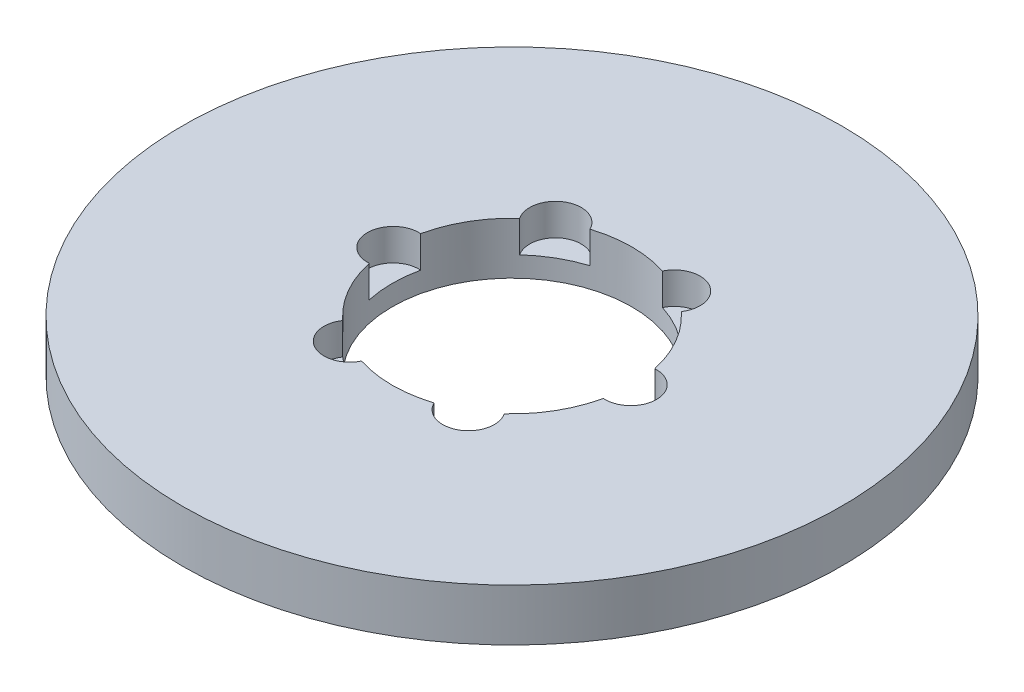
ISO-10303-21;
HEADER;
FILE_DESCRIPTION(('STEP AP214'),'2;1');
FILE_NAME('part.step','',(''),(''),'','','');
FILE_SCHEMA(('AUTOMOTIVE_DESIGN { 1 0 10303 214 1 1 1 1 }'));
ENDSEC;
DATA;
#1=APPLICATION_CONTEXT('core data for automotive mechanical design processes');
#2=APPLICATION_PROTOCOL_DEFINITION('international standard','automotive_design',2000,#1);
#3=PRODUCT_CONTEXT('',#1,'mechanical');
#4=PRODUCT('Part','Part','',(#3));
#5=PRODUCT_RELATED_PRODUCT_CATEGORY('part','',(#4));
#6=PRODUCT_DEFINITION_FORMATION('','',#4);
#7=PRODUCT_DEFINITION_CONTEXT('part definition',#1,'design');
#8=PRODUCT_DEFINITION('design','',#6,#7);
#9=PRODUCT_DEFINITION_SHAPE('','',#8);
#10=(LENGTH_UNIT() NAMED_UNIT(*) SI_UNIT(.MILLI.,.METRE.));
#11=(NAMED_UNIT(*) PLANE_ANGLE_UNIT() SI_UNIT($,.RADIAN.));
#12=(NAMED_UNIT(*) SI_UNIT($,.STERADIAN.) SOLID_ANGLE_UNIT());
#13=UNCERTAINTY_MEASURE_WITH_UNIT(LENGTH_MEASURE(1.E-05),#10,'distance_accuracy_value','');
#14=(GEOMETRIC_REPRESENTATION_CONTEXT(3) GLOBAL_UNCERTAINTY_ASSIGNED_CONTEXT((#13)) GLOBAL_UNIT_ASSIGNED_CONTEXT((#10,
#11,#12)) REPRESENTATION_CONTEXT('',''));
#15=CARTESIAN_POINT('',(0.,0.,0.));
#16=DIRECTION('',(0.,0.,1.));
#17=DIRECTION('',(1.,0.,0.));
#18=AXIS2_PLACEMENT_3D('',#15,#16,#17);
#19=CARTESIAN_POINT('',(0.,13.,0.));
#20=DIRECTION('',(0.,-1.,0.));
#21=DIRECTION('',(0.,0.,-1.));
#22=AXIS2_PLACEMENT_3D('',#19,#20,#21);
#23=CYLINDRICAL_SURFACE('',#22,82.5);
#24=CARTESIAN_POINT('',(0.,13.,0.));
#25=DIRECTION('',(0.,1.,0.));
#26=DIRECTION('',(0.,0.,1.));
#27=AXIS2_PLACEMENT_3D('',#24,#25,#26);
#28=CIRCLE('',#27,82.5);
#29=CARTESIAN_POINT('',(0.,13.,-82.5));
#30=VERTEX_POINT('',#29);
#31=EDGE_CURVE('E171',#30,#30,#28,.T.);
#32=CARTESIAN_POINT('',(0.,0.,0.));
#33=DIRECTION('',(0.,1.,0.));
#34=DIRECTION('',(0.,0.,1.));
#35=AXIS2_PLACEMENT_3D('',#32,#33,#34);
#36=CIRCLE('',#35,82.5);
#37=CARTESIAN_POINT('',(0.,0.,-82.5));
#38=VERTEX_POINT('',#37);
#39=EDGE_CURVE('E157',#38,#38,#36,.T.);
#40=CARTESIAN_POINT('',(0.,13.,-82.5));
#41=CARTESIAN_POINT('',(0.,12.8645833333333,-82.5));
#42=CARTESIAN_POINT('',(0.,12.7291666666667,-82.5));
#43=CARTESIAN_POINT('',(0.,12.4583333333333,-82.5));
#44=CARTESIAN_POINT('',(0.,12.3229166666667,-82.5));
#45=CARTESIAN_POINT('',(0.,12.0520833333333,-82.5));
#46=CARTESIAN_POINT('',(0.,11.9166666666667,-82.5));
#47=CARTESIAN_POINT('',(0.,11.6458333333333,-82.5));
#48=CARTESIAN_POINT('',(0.,11.5104166666667,-82.5));
#49=CARTESIAN_POINT('',(0.,11.2395833333333,-82.5));
#50=CARTESIAN_POINT('',(0.,11.1041666666667,-82.5));
#51=CARTESIAN_POINT('',(0.,10.8333333333333,-82.5));
#52=CARTESIAN_POINT('',(0.,10.6979166666667,-82.5));
#53=CARTESIAN_POINT('',(0.,10.4270833333333,-82.5));
#54=CARTESIAN_POINT('',(0.,10.2916666666667,-82.5));
#55=CARTESIAN_POINT('',(0.,10.0208333333333,-82.5));
#56=CARTESIAN_POINT('',(0.,9.88541666666667,-82.5));
#57=CARTESIAN_POINT('',(0.,9.61458333333333,-82.5));
#58=CARTESIAN_POINT('',(0.,9.47916666666667,-82.5));
#59=CARTESIAN_POINT('',(0.,9.20833333333333,-82.5));
#60=CARTESIAN_POINT('',(0.,9.07291666666667,-82.5));
#61=CARTESIAN_POINT('',(0.,8.80208333333333,-82.5));
#62=CARTESIAN_POINT('',(0.,8.66666666666667,-82.5));
#63=CARTESIAN_POINT('',(0.,8.39583333333333,-82.5));
#64=CARTESIAN_POINT('',(0.,8.26041666666667,-82.5));
#65=CARTESIAN_POINT('',(0.,7.98958333333333,-82.5));
#66=CARTESIAN_POINT('',(0.,7.85416666666667,-82.5));
#67=CARTESIAN_POINT('',(0.,7.58333333333333,-82.5));
#68=CARTESIAN_POINT('',(0.,7.44791666666667,-82.5));
#69=CARTESIAN_POINT('',(0.,7.17708333333333,-82.5));
#70=CARTESIAN_POINT('',(0.,7.04166666666667,-82.5));
#71=CARTESIAN_POINT('',(0.,6.77083333333333,-82.5));
#72=CARTESIAN_POINT('',(0.,6.63541666666667,-82.5));
#73=CARTESIAN_POINT('',(0.,6.36458333333333,-82.5));
#74=CARTESIAN_POINT('',(0.,6.22916666666667,-82.5));
#75=CARTESIAN_POINT('',(0.,5.95833333333333,-82.5));
#76=CARTESIAN_POINT('',(0.,5.82291666666667,-82.5));
#77=CARTESIAN_POINT('',(0.,5.55208333333333,-82.5));
#78=CARTESIAN_POINT('',(0.,5.41666666666667,-82.5));
#79=CARTESIAN_POINT('',(0.,5.14583333333333,-82.5));
#80=CARTESIAN_POINT('',(0.,5.01041666666667,-82.5));
#81=CARTESIAN_POINT('',(0.,4.73958333333333,-82.5));
#82=CARTESIAN_POINT('',(0.,4.60416666666667,-82.5));
#83=CARTESIAN_POINT('',(0.,4.33333333333333,-82.5));
#84=CARTESIAN_POINT('',(0.,4.19791666666667,-82.5));
#85=CARTESIAN_POINT('',(0.,3.92708333333333,-82.5));
#86=CARTESIAN_POINT('',(0.,3.79166666666667,-82.5));
#87=CARTESIAN_POINT('',(0.,3.52083333333333,-82.5));
#88=CARTESIAN_POINT('',(0.,3.38541666666667,-82.5));
#89=CARTESIAN_POINT('',(0.,3.11458333333333,-82.5));
#90=CARTESIAN_POINT('',(0.,2.97916666666667,-82.5));
#91=CARTESIAN_POINT('',(0.,2.70833333333333,-82.5));
#92=CARTESIAN_POINT('',(0.,2.57291666666667,-82.5));
#93=CARTESIAN_POINT('',(0.,2.30208333333333,-82.5));
#94=CARTESIAN_POINT('',(0.,2.16666666666667,-82.5));
#95=CARTESIAN_POINT('',(0.,1.89583333333333,-82.5));
#96=CARTESIAN_POINT('',(0.,1.76041666666667,-82.5));
#97=CARTESIAN_POINT('',(0.,1.48958333333333,-82.5));
#98=CARTESIAN_POINT('',(0.,1.35416666666667,-82.5));
#99=CARTESIAN_POINT('',(0.,1.08333333333333,-82.5));
#100=CARTESIAN_POINT('',(0.,0.947916666666667,-82.5));
#101=CARTESIAN_POINT('',(0.,0.677083333333334,-82.5));
#102=CARTESIAN_POINT('',(0.,0.541666666666667,-82.5));
#103=CARTESIAN_POINT('',(0.,0.270833333333334,-82.5));
#104=CARTESIAN_POINT('',(0.,0.135416666666667,-82.5));
#105=CARTESIAN_POINT('',(0.,0.,-82.5));
#106=B_SPLINE_CURVE_WITH_KNOTS('',3,(#40,#41,#42,#43,#44,#45,#46,#47,#48,#49,#50,#51,#52,#53,
#54,#55,#56,#57,#58,#59,#60,#61,#62,#63,#64,#65,#66,#67,#68,#69,#70,#71,#72,#73,#74,#75,#76,#77,
#78,#79,#80,#81,#82,#83,#84,#85,#86,#87,#88,#89,#90,#91,#92,#93,#94,#95,#96,#97,#98,#99,#100,
#101,#102,#103,#104,#105),.UNSPECIFIED.,.F.,.F.,(4,2,2,2,2,2,2,2,2,2,2,2,2,2,2,2,2,2,2,2,2,2,2,
2,2,2,2,2,2,2,2,2,4),(0.,0.406249999999999,0.812499999999999,1.21875,1.625,2.03125,2.4375,
2.84375,3.25,3.65625,4.0625,4.46875,4.875,5.28125,5.6875,6.09375,6.5,6.90625,7.3125,7.71875,
8.125,8.53125,8.9375,9.34375,9.75,10.15625,10.5625,10.96875,11.375,11.78125,12.1875,12.59375,
13.),.UNSPECIFIED.);
#107=EDGE_CURVE('BSEAM39',#30,#38,#106,.T.);
#108=ORIENTED_EDGE('',*,*,#31,.F.);
#109=ORIENTED_EDGE('',*,*,#39,.T.);
#110=ORIENTED_EDGE('',*,*,#107,.T.);
#111=ORIENTED_EDGE('',*,*,#107,.F.);
#112=EDGE_LOOP('',(#108,#110,#109,#111));
#113=FACE_BOUND('',#112,.T.);
#114=ADVANCED_FACE('F39',(#113),#23,.T.);
#115=CARTESIAN_POINT('',(0.,13.,0.));
#116=DIRECTION('',(0.,1.,0.));
#117=DIRECTION('',(0.,0.,1.));
#118=AXIS2_PLACEMENT_3D('',#115,#116,#117);
#119=PLANE('',#118);
#120=CARTESIAN_POINT('',(-14.8691706785594,13.,-25.7541590816776));
#121=DIRECTION('',(0.,1.,0.));
#122=DIRECTION('',(-0.866025403784433,0.,0.50000000000001));
#123=AXIS2_PLACEMENT_3D('',#120,#121,#122);
#124=CIRCLE('',#123,6.45171748222885);
#125=CARTESIAN_POINT('',(-9.07613420516261,13.,-28.5941215617804));
#126=VERTEX_POINT('',#125);
#127=CARTESIAN_POINT('',(-20.2251685688214,13.,-22.1572235707175));
#128=VERTEX_POINT('',#127);
#129=EDGE_CURVE('E214',#126,#128,#124,.T.);
#130=ORIENTED_EDGE('',*,*,#129,.F.);
#131=CARTESIAN_POINT('',(0.,13.,0.));
#132=DIRECTION('',(0.,1.,0.));
#133=DIRECTION('',(0.,0.,1.));
#134=AXIS2_PLACEMENT_3D('',#131,#132,#133);
#135=CIRCLE('',#134,30.);
#136=CARTESIAN_POINT('',(9.07613420516201,13.,-28.5941215617806));
#137=VERTEX_POINT('',#136);
#138=EDGE_CURVE('E272',#137,#126,#135,.T.);
#139=ORIENTED_EDGE('',*,*,#138,.F.);
#140=CARTESIAN_POINT('',(14.8691706785588,13.,-25.7541590816779));
#141=DIRECTION('',(0.,1.,0.));
#142=DIRECTION('',(-0.866025403784443,0.,-0.499999999999992));
#143=AXIS2_PLACEMENT_3D('',#140,#141,#142);
#144=CIRCLE('',#143,6.45171748222885);
#145=CARTESIAN_POINT('',(20.225168568821,13.,-22.1572235707179));
#146=VERTEX_POINT('',#145);
#147=EDGE_CURVE('E285',#146,#137,#144,.T.);
#148=ORIENTED_EDGE('',*,*,#147,.F.);
#149=CARTESIAN_POINT('',(29.3013027739835,13.,-6.43689799106285));
#150=VERTEX_POINT('',#149);
#151=EDGE_CURVE('E165',#150,#146,#135,.T.);
#152=ORIENTED_EDGE('',*,*,#151,.F.);
#153=CARTESIAN_POINT('',(29.7383413571182,13.,0.));
#154=DIRECTION('',(0.,1.,0.));
#155=DIRECTION('',(0.,0.,-1.));
#156=AXIS2_PLACEMENT_3D('',#153,#154,#155);
#157=CIRCLE('',#156,6.45171748222885);
#158=CARTESIAN_POINT('',(29.3013027739835,13.,6.43689799106285));
#159=VERTEX_POINT('',#158);
#160=EDGE_CURVE('E281',#159,#150,#157,.T.);
#161=ORIENTED_EDGE('',*,*,#160,.F.);
#162=CARTESIAN_POINT('',(20.2251685688213,13.,22.1572235707176));
#163=VERTEX_POINT('',#162);
#164=EDGE_CURVE('E160',#163,#159,#135,.T.);
#165=ORIENTED_EDGE('',*,*,#164,.F.);
#166=CARTESIAN_POINT('',(14.8691706785592,13.,25.7541590816777));
#167=DIRECTION('',(0.,1.,0.));
#168=DIRECTION('',(0.866025403784436,0.,-0.500000000000004));
#169=AXIS2_PLACEMENT_3D('',#166,#167,#168);
#170=CIRCLE('',#169,6.45171748222885);
#171=CARTESIAN_POINT('',(9.07613420516241,13.,28.5941215617805));
#172=VERTEX_POINT('',#171);
#173=EDGE_CURVE('E154',#172,#163,#170,.T.);
#174=ORIENTED_EDGE('',*,*,#173,.F.);
#175=CARTESIAN_POINT('',(-9.07613420516221,13.,28.5941215617806));
#176=VERTEX_POINT('',#175);
#177=EDGE_CURVE('E150',#176,#172,#135,.T.);
#178=ORIENTED_EDGE('',*,*,#177,.F.);
#179=CARTESIAN_POINT('',(-14.869170678559,13.,25.7541590816778));
#180=DIRECTION('',(0.,1.,0.));
#181=DIRECTION('',(0.86602540378444,0.,0.499999999999998));
#182=AXIS2_PLACEMENT_3D('',#179,#180,#181);
#183=CIRCLE('',#182,6.45171748222885);
#184=CARTESIAN_POINT('',(-20.2251685688211,13.,22.1572235707177));
#185=VERTEX_POINT('',#184);
#186=EDGE_CURVE('E127',#185,#176,#183,.T.);
#187=ORIENTED_EDGE('',*,*,#186,.F.);
#188=CARTESIAN_POINT('',(-29.3013027739835,13.,6.43689799106285));
#189=VERTEX_POINT('',#188);
#190=EDGE_CURVE('E156',#189,#185,#135,.T.);
#191=ORIENTED_EDGE('',*,*,#190,.F.);
#192=CARTESIAN_POINT('',(-29.7383413571182,13.,0.));
#193=DIRECTION('',(0.,1.,0.));
#194=DIRECTION('',(0.,0.,1.));
#195=AXIS2_PLACEMENT_3D('',#192,#193,#194);
#196=CIRCLE('',#195,6.45171748222885);
#197=CARTESIAN_POINT('',(-29.3013027739835,13.,-6.43689799106285));
#198=VERTEX_POINT('',#197);
#199=EDGE_CURVE('E164',#198,#189,#196,.T.);
#200=ORIENTED_EDGE('',*,*,#199,.F.);
#201=EDGE_CURVE('E159',#128,#198,#135,.T.);
#202=ORIENTED_EDGE('',*,*,#201,.F.);
#203=EDGE_LOOP('',(#130,#139,#148,#152,#161,#165,#174,#178,#187,#191,#200,#202));
#204=FACE_BOUND('',#203,.T.);
#205=ORIENTED_EDGE('',*,*,#31,.T.);
#206=EDGE_LOOP('',(#205));
#207=FACE_BOUND('',#206,.T.);
#208=ADVANCED_FACE('F155',(#204,#207),#119,.T.);
#209=CARTESIAN_POINT('',(0.,0.,0.));
#210=DIRECTION('',(0.,1.,0.));
#211=DIRECTION('',(0.,0.,1.));
#212=AXIS2_PLACEMENT_3D('',#209,#210,#211);
#213=PLANE('',#212);
#214=CARTESIAN_POINT('',(0.,0.,0.));
#215=DIRECTION('',(0.,1.,0.));
#216=DIRECTION('',(0.,0.,1.));
#217=AXIS2_PLACEMENT_3D('',#214,#215,#216);
#218=CIRCLE('',#217,30.);
#219=CARTESIAN_POINT('',(0.,0.,30.));
#220=VERTEX_POINT('',#219);
#221=EDGE_CURVE('E170',#220,#220,#218,.T.);
#222=ORIENTED_EDGE('',*,*,#221,.T.);
#223=EDGE_LOOP('',(#222));
#224=FACE_BOUND('',#223,.T.);
#225=ORIENTED_EDGE('',*,*,#39,.F.);
#226=EDGE_LOOP('',(#225));
#227=FACE_BOUND('',#226,.T.);
#228=ADVANCED_FACE('F232',(#224,#227),#213,.F.);
#229=CARTESIAN_POINT('',(0.,13.,0.));
#230=DIRECTION('',(0.,-1.,0.));
#231=DIRECTION('',(0.,0.,-1.));
#232=AXIS2_PLACEMENT_3D('',#229,#230,#231);
#233=CYLINDRICAL_SURFACE('',#232,30.);
#234=DIRECTION('',(0.,1.,0.));
#235=VECTOR('',#234,1.);
#236=CARTESIAN_POINT('',(-9.07613420516261,9.03915069976995,-28.5941215617804));
#237=LINE('',#236,#235);
#238=CARTESIAN_POINT('',(-9.07613420516261,5.0783013995399,-28.5941215617804));
#239=VERTEX_POINT('',#238);
#240=EDGE_CURVE('E11',#239,#126,#237,.T.);
#241=ORIENTED_EDGE('',*,*,#240,.F.);
#242=CARTESIAN_POINT('',(0.,5.0783013995399,0.));
#243=DIRECTION('',(0.,1.,0.));
#244=DIRECTION('',(0.,0.,1.));
#245=AXIS2_PLACEMENT_3D('',#242,#243,#244);
#246=CIRCLE('',#245,30.);
#247=CARTESIAN_POINT('',(-20.2251685688214,5.0783013995399,-22.1572235707175));
#248=VERTEX_POINT('',#247);
#249=EDGE_CURVE('E209',#239,#248,#246,.T.);
#250=ORIENTED_EDGE('',*,*,#249,.T.);
#251=DIRECTION('',(0.,1.,0.));
#252=VECTOR('',#251,1.);
#253=CARTESIAN_POINT('',(-20.2251685688214,9.03915069976995,-22.1572235707175));
#254=LINE('',#253,#252);
#255=EDGE_CURVE('E46',#128,#248,#254,.F.);
#256=ORIENTED_EDGE('',*,*,#255,.F.);
#257=ORIENTED_EDGE('',*,*,#201,.T.);
#258=DIRECTION('',(0.,1.,0.));
#259=VECTOR('',#258,1.);
#260=CARTESIAN_POINT('',(-29.3013027739835,9.03915069976995,-6.43689799106286));
#261=LINE('',#260,#259);
#262=CARTESIAN_POINT('',(-29.3013027739835,5.0783013995399,-6.43689799106285));
#263=VERTEX_POINT('',#262);
#264=EDGE_CURVE('E185',#263,#198,#261,.T.);
#265=ORIENTED_EDGE('',*,*,#264,.F.);
#266=CARTESIAN_POINT('',(0.,5.0783013995399,0.));
#267=DIRECTION('',(0.,1.,0.));
#268=DIRECTION('',(0.,0.,1.));
#269=AXIS2_PLACEMENT_3D('',#266,#267,#268);
#270=CIRCLE('',#269,30.);
#271=CARTESIAN_POINT('',(-29.3013027739835,5.0783013995399,6.43689799106285));
#272=VERTEX_POINT('',#271);
#273=EDGE_CURVE('E173',#263,#272,#270,.T.);
#274=ORIENTED_EDGE('',*,*,#273,.T.);
#275=DIRECTION('',(0.,1.,0.));
#276=VECTOR('',#275,1.);
#277=CARTESIAN_POINT('',(-29.3013027739835,9.03915069976995,6.43689799106286));
#278=LINE('',#277,#276);
#279=EDGE_CURVE('E178',#189,#272,#278,.F.);
#280=ORIENTED_EDGE('',*,*,#279,.F.);
#281=ORIENTED_EDGE('',*,*,#190,.T.);
#282=DIRECTION('',(0.,1.,0.));
#283=VECTOR('',#282,1.);
#284=CARTESIAN_POINT('',(-20.2251685688211,9.03915069976995,22.1572235707177));
#285=LINE('',#284,#283);
#286=CARTESIAN_POINT('',(-20.2251685688211,5.0783013995399,22.1572235707177));
#287=VERTEX_POINT('',#286);
#288=EDGE_CURVE('E132',#287,#185,#285,.T.);
#289=ORIENTED_EDGE('',*,*,#288,.F.);
#290=CARTESIAN_POINT('',(0.,5.0783013995399,0.));
#291=DIRECTION('',(0.,1.,0.));
#292=DIRECTION('',(0.,0.,1.));
#293=AXIS2_PLACEMENT_3D('',#290,#291,#292);
#294=CIRCLE('',#293,30.);
#295=CARTESIAN_POINT('',(-9.07613420516221,5.0783013995399,28.5941215617806));
#296=VERTEX_POINT('',#295);
#297=EDGE_CURVE('E146',#287,#296,#294,.T.);
#298=ORIENTED_EDGE('',*,*,#297,.T.);
#299=DIRECTION('',(0.,1.,0.));
#300=VECTOR('',#299,1.);
#301=CARTESIAN_POINT('',(-9.07613420516222,9.03915069976995,28.5941215617806));
#302=LINE('',#301,#300);
#303=EDGE_CURVE('E128',#176,#296,#302,.F.);
#304=ORIENTED_EDGE('',*,*,#303,.F.);
#305=ORIENTED_EDGE('',*,*,#177,.T.);
#306=DIRECTION('',(0.,1.,0.));
#307=VECTOR('',#306,1.);
#308=CARTESIAN_POINT('',(9.07613420516241,9.03915069976995,28.5941215617805));
#309=LINE('',#308,#307);
#310=CARTESIAN_POINT('',(9.07613420516241,5.0783013995399,28.5941215617805));
#311=VERTEX_POINT('',#310);
#312=EDGE_CURVE('E192',#311,#172,#309,.T.);
#313=ORIENTED_EDGE('',*,*,#312,.F.);
#314=CARTESIAN_POINT('',(0.,5.0783013995399,0.));
#315=DIRECTION('',(0.,1.,0.));
#316=DIRECTION('',(0.,0.,1.));
#317=AXIS2_PLACEMENT_3D('',#314,#315,#316);
#318=CIRCLE('',#317,30.);
#319=CARTESIAN_POINT('',(20.2251685688213,5.0783013995399,22.1572235707176));
#320=VERTEX_POINT('',#319);
#321=EDGE_CURVE('E190',#311,#320,#318,.T.);
#322=ORIENTED_EDGE('',*,*,#321,.T.);
#323=DIRECTION('',(0.,1.,0.));
#324=VECTOR('',#323,1.);
#325=CARTESIAN_POINT('',(20.2251685688213,9.03915069976995,22.1572235707176));
#326=LINE('',#325,#324);
#327=EDGE_CURVE('E189',#163,#320,#326,.F.);
#328=ORIENTED_EDGE('',*,*,#327,.F.);
#329=ORIENTED_EDGE('',*,*,#164,.T.);
#330=DIRECTION('',(0.,1.,0.));
#331=VECTOR('',#330,1.);
#332=CARTESIAN_POINT('',(29.3013027739835,9.03915069976995,6.43689799106286));
#333=LINE('',#332,#331);
#334=CARTESIAN_POINT('',(29.3013027739835,5.0783013995399,6.43689799106285));
#335=VERTEX_POINT('',#334);
#336=EDGE_CURVE('E203',#335,#159,#333,.T.);
#337=ORIENTED_EDGE('',*,*,#336,.F.);
#338=CARTESIAN_POINT('',(0.,5.0783013995399,0.));
#339=DIRECTION('',(0.,1.,0.));
#340=DIRECTION('',(0.,0.,1.));
#341=AXIS2_PLACEMENT_3D('',#338,#339,#340);
#342=CIRCLE('',#341,30.);
#343=CARTESIAN_POINT('',(29.3013027739835,5.0783013995399,-6.43689799106285));
#344=VERTEX_POINT('',#343);
#345=EDGE_CURVE('E194',#335,#344,#342,.T.);
#346=ORIENTED_EDGE('',*,*,#345,.T.);
#347=DIRECTION('',(0.,1.,0.));
#348=VECTOR('',#347,1.);
#349=CARTESIAN_POINT('',(29.3013027739835,9.03915069976995,-6.43689799106286));
#350=LINE('',#349,#348);
#351=EDGE_CURVE('E196',#150,#344,#350,.F.);
#352=ORIENTED_EDGE('',*,*,#351,.F.);
#353=ORIENTED_EDGE('',*,*,#151,.T.);
#354=DIRECTION('',(0.,1.,0.));
#355=VECTOR('',#354,1.);
#356=CARTESIAN_POINT('',(20.225168568821,9.03915069976995,-22.1572235707179));
#357=LINE('',#356,#355);
#358=CARTESIAN_POINT('',(20.225168568821,5.0783013995399,-22.1572235707179));
#359=VERTEX_POINT('',#358);
#360=EDGE_CURVE('E208',#359,#146,#357,.T.);
#361=ORIENTED_EDGE('',*,*,#360,.F.);
#362=CARTESIAN_POINT('',(0.,5.0783013995399,0.));
#363=DIRECTION('',(0.,1.,0.));
#364=DIRECTION('',(0.,0.,1.));
#365=AXIS2_PLACEMENT_3D('',#362,#363,#364);
#366=CIRCLE('',#365,30.);
#367=CARTESIAN_POINT('',(9.07613420516201,5.0783013995399,-28.5941215617806));
#368=VERTEX_POINT('',#367);
#369=EDGE_CURVE('E201',#359,#368,#366,.T.);
#370=ORIENTED_EDGE('',*,*,#369,.T.);
#371=DIRECTION('',(0.,1.,0.));
#372=VECTOR('',#371,1.);
#373=CARTESIAN_POINT('',(9.07613420516202,9.03915069976995,-28.5941215617806));
#374=LINE('',#373,#372);
#375=EDGE_CURVE('E206',#137,#368,#374,.F.);
#376=ORIENTED_EDGE('',*,*,#375,.F.);
#377=ORIENTED_EDGE('',*,*,#138,.T.);
#378=EDGE_LOOP('',(#241,#250,#256,#257,#265,#274,#280,#281,#289,#298,#304,#305,#313,#322,#328,
#329,#337,#346,#352,#353,#361,#370,#376,#377));
#379=FACE_BOUND('',#378,.T.);
#380=ORIENTED_EDGE('',*,*,#221,.F.);
#381=EDGE_LOOP('',(#380));
#382=FACE_BOUND('',#381,.T.);
#383=ADVANCED_FACE('F145',(#379,#382),#233,.F.);
#384=CARTESIAN_POINT('',(-29.7383413571182,5.0783013995399,0.));
#385=DIRECTION('',(0.,1.,0.));
#386=DIRECTION('',(0.,0.,1.));
#387=AXIS2_PLACEMENT_3D('',#384,#385,#386);
#388=CYLINDRICAL_SURFACE('',#387,6.45171748222885);
#389=ORIENTED_EDGE('',*,*,#264,.T.);
#390=ORIENTED_EDGE('',*,*,#199,.T.);
#391=ORIENTED_EDGE('',*,*,#279,.T.);
#392=CARTESIAN_POINT('',(-29.7383413571182,5.0783013995399,0.));
#393=DIRECTION('',(0.,1.,0.));
#394=DIRECTION('',(0.,0.,1.));
#395=AXIS2_PLACEMENT_3D('',#392,#393,#394);
#396=CIRCLE('',#395,6.45171748222885);
#397=EDGE_CURVE('E168',#263,#272,#396,.T.);
#398=ORIENTED_EDGE('',*,*,#397,.F.);
#399=EDGE_LOOP('',(#389,#390,#391,#398));
#400=FACE_BOUND('',#399,.T.);
#401=ADVANCED_FACE('F243',(#400),#388,.F.);
#402=CARTESIAN_POINT('',(-29.7383413571182,5.0783013995399,0.));
#403=DIRECTION('',(0.,1.,0.));
#404=DIRECTION('',(0.,0.,1.));
#405=AXIS2_PLACEMENT_3D('',#402,#403,#404);
#406=PLANE('',#405);
#407=ORIENTED_EDGE('',*,*,#397,.T.);
#408=ORIENTED_EDGE('',*,*,#273,.F.);
#409=EDGE_LOOP('',(#407,#408));
#410=FACE_BOUND('',#409,.T.);
#411=ADVANCED_FACE('F247',(#410),#406,.T.);
#412=CARTESIAN_POINT('',(-14.869170678559,5.0783013995399,25.7541590816778));
#413=DIRECTION('',(0.,1.,0.));
#414=DIRECTION('',(0.,0.,1.));
#415=AXIS2_PLACEMENT_3D('',#412,#413,#414);
#416=CYLINDRICAL_SURFACE('',#415,6.45171748222885);
#417=ORIENTED_EDGE('',*,*,#288,.T.);
#418=ORIENTED_EDGE('',*,*,#186,.T.);
#419=ORIENTED_EDGE('',*,*,#303,.T.);
#420=CARTESIAN_POINT('',(-14.869170678559,5.0783013995399,25.7541590816778));
#421=DIRECTION('',(0.,1.,0.));
#422=DIRECTION('',(0.86602540378444,0.,0.499999999999998));
#423=AXIS2_PLACEMENT_3D('',#420,#421,#422);
#424=CIRCLE('',#423,6.45171748222885);
#425=EDGE_CURVE('E137',#287,#296,#424,.T.);
#426=ORIENTED_EDGE('',*,*,#425,.F.);
#427=EDGE_LOOP('',(#417,#418,#419,#426));
#428=FACE_BOUND('',#427,.T.);
#429=ADVANCED_FACE('F126',(#428),#416,.F.);
#430=CARTESIAN_POINT('',(-14.869170678559,5.0783013995399,25.7541590816778));
#431=DIRECTION('',(0.,1.,0.));
#432=DIRECTION('',(0.86602540378444,0.,0.499999999999998));
#433=AXIS2_PLACEMENT_3D('',#430,#431,#432);
#434=PLANE('',#433);
#435=ORIENTED_EDGE('',*,*,#425,.T.);
#436=ORIENTED_EDGE('',*,*,#297,.F.);
#437=EDGE_LOOP('',(#435,#436));
#438=FACE_BOUND('',#437,.T.);
#439=ADVANCED_FACE('F254',(#438),#434,.T.);
#440=CARTESIAN_POINT('',(14.8691706785592,5.0783013995399,25.7541590816777));
#441=DIRECTION('',(0.,1.,0.));
#442=DIRECTION('',(0.,0.,1.));
#443=AXIS2_PLACEMENT_3D('',#440,#441,#442);
#444=CYLINDRICAL_SURFACE('',#443,6.45171748222885);
#445=ORIENTED_EDGE('',*,*,#312,.T.);
#446=ORIENTED_EDGE('',*,*,#173,.T.);
#447=ORIENTED_EDGE('',*,*,#327,.T.);
#448=CARTESIAN_POINT('',(14.8691706785592,5.0783013995399,25.7541590816777));
#449=DIRECTION('',(0.,1.,0.));
#450=DIRECTION('',(0.866025403784436,0.,-0.500000000000004));
#451=AXIS2_PLACEMENT_3D('',#448,#449,#450);
#452=CIRCLE('',#451,6.45171748222885);
#453=EDGE_CURVE('E138',#311,#320,#452,.T.);
#454=ORIENTED_EDGE('',*,*,#453,.F.);
#455=EDGE_LOOP('',(#445,#446,#447,#454));
#456=FACE_BOUND('',#455,.T.);
#457=ADVANCED_FACE('F260',(#456),#444,.F.);
#458=CARTESIAN_POINT('',(14.8691706785592,5.0783013995399,25.7541590816777));
#459=DIRECTION('',(0.,1.,0.));
#460=DIRECTION('',(0.866025403784436,0.,-0.500000000000004));
#461=AXIS2_PLACEMENT_3D('',#458,#459,#460);
#462=PLANE('',#461);
#463=ORIENTED_EDGE('',*,*,#453,.T.);
#464=ORIENTED_EDGE('',*,*,#321,.F.);
#465=EDGE_LOOP('',(#463,#464));
#466=FACE_BOUND('',#465,.T.);
#467=ADVANCED_FACE('F265',(#466),#462,.T.);
#468=CARTESIAN_POINT('',(29.7383413571182,5.0783013995399,0.));
#469=DIRECTION('',(0.,1.,0.));
#470=DIRECTION('',(0.,0.,1.));
#471=AXIS2_PLACEMENT_3D('',#468,#469,#470);
#472=CYLINDRICAL_SURFACE('',#471,6.45171748222885);
#473=ORIENTED_EDGE('',*,*,#336,.T.);
#474=ORIENTED_EDGE('',*,*,#160,.T.);
#475=ORIENTED_EDGE('',*,*,#351,.T.);
#476=CARTESIAN_POINT('',(29.7383413571182,5.0783013995399,0.));
#477=DIRECTION('',(0.,1.,0.));
#478=DIRECTION('',(0.,0.,-1.));
#479=AXIS2_PLACEMENT_3D('',#476,#477,#478);
#480=CIRCLE('',#479,6.45171748222885);
#481=EDGE_CURVE('E287',#335,#344,#480,.T.);
#482=ORIENTED_EDGE('',*,*,#481,.F.);
#483=EDGE_LOOP('',(#473,#474,#475,#482));
#484=FACE_BOUND('',#483,.T.);
#485=ADVANCED_FACE('F300',(#484),#472,.F.);
#486=CARTESIAN_POINT('',(29.7383413571182,5.0783013995399,0.));
#487=DIRECTION('',(0.,1.,0.));
#488=DIRECTION('',(0.,0.,-1.));
#489=AXIS2_PLACEMENT_3D('',#486,#487,#488);
#490=PLANE('',#489);
#491=ORIENTED_EDGE('',*,*,#481,.T.);
#492=ORIENTED_EDGE('',*,*,#345,.F.);
#493=EDGE_LOOP('',(#491,#492));
#494=FACE_BOUND('',#493,.T.);
#495=ADVANCED_FACE('F298',(#494),#490,.T.);
#496=CARTESIAN_POINT('',(14.8691706785588,5.0783013995399,-25.7541590816779));
#497=DIRECTION('',(0.,1.,0.));
#498=DIRECTION('',(0.,0.,1.));
#499=AXIS2_PLACEMENT_3D('',#496,#497,#498);
#500=CYLINDRICAL_SURFACE('',#499,6.45171748222885);
#501=ORIENTED_EDGE('',*,*,#360,.T.);
#502=ORIENTED_EDGE('',*,*,#147,.T.);
#503=ORIENTED_EDGE('',*,*,#375,.T.);
#504=CARTESIAN_POINT('',(14.8691706785588,5.0783013995399,-25.7541590816779));
#505=DIRECTION('',(0.,1.,0.));
#506=DIRECTION('',(-0.866025403784443,0.,-0.499999999999992));
#507=AXIS2_PLACEMENT_3D('',#504,#505,#506);
#508=CIRCLE('',#507,6.45171748222885);
#509=EDGE_CURVE('E56',#359,#368,#508,.T.);
#510=ORIENTED_EDGE('',*,*,#509,.F.);
#511=EDGE_LOOP('',(#501,#502,#503,#510));
#512=FACE_BOUND('',#511,.T.);
#513=ADVANCED_FACE('F301',(#512),#500,.F.);
#514=CARTESIAN_POINT('',(14.8691706785588,5.0783013995399,-25.7541590816779));
#515=DIRECTION('',(0.,1.,0.));
#516=DIRECTION('',(-0.866025403784443,0.,-0.499999999999992));
#517=AXIS2_PLACEMENT_3D('',#514,#515,#516);
#518=PLANE('',#517);
#519=ORIENTED_EDGE('',*,*,#509,.T.);
#520=ORIENTED_EDGE('',*,*,#369,.F.);
#521=EDGE_LOOP('',(#519,#520));
#522=FACE_BOUND('',#521,.T.);
#523=ADVANCED_FACE('F221',(#522),#518,.T.);
#524=CARTESIAN_POINT('',(-14.8691706785594,5.0783013995399,-25.7541590816776));
#525=DIRECTION('',(0.,1.,0.));
#526=DIRECTION('',(0.,0.,1.));
#527=AXIS2_PLACEMENT_3D('',#524,#525,#526);
#528=CYLINDRICAL_SURFACE('',#527,6.45171748222885);
#529=ORIENTED_EDGE('',*,*,#240,.T.);
#530=ORIENTED_EDGE('',*,*,#129,.T.);
#531=ORIENTED_EDGE('',*,*,#255,.T.);
#532=CARTESIAN_POINT('',(-14.8691706785594,5.0783013995399,-25.7541590816776));
#533=DIRECTION('',(0.,1.,0.));
#534=DIRECTION('',(-0.866025403784433,0.,0.50000000000001));
#535=AXIS2_PLACEMENT_3D('',#532,#533,#534);
#536=CIRCLE('',#535,6.45171748222885);
#537=EDGE_CURVE('E55',#239,#248,#536,.T.);
#538=ORIENTED_EDGE('',*,*,#537,.F.);
#539=EDGE_LOOP('',(#529,#530,#531,#538));
#540=FACE_BOUND('',#539,.T.);
#541=ADVANCED_FACE('F212',(#540),#528,.F.);
#542=CARTESIAN_POINT('',(-14.8691706785594,5.0783013995399,-25.7541590816776));
#543=DIRECTION('',(0.,1.,0.));
#544=DIRECTION('',(-0.866025403784433,0.,0.50000000000001));
#545=AXIS2_PLACEMENT_3D('',#542,#543,#544);
#546=PLANE('',#545);
#547=ORIENTED_EDGE('',*,*,#537,.T.);
#548=ORIENTED_EDGE('',*,*,#249,.F.);
#549=EDGE_LOOP('',(#547,#548));
#550=FACE_BOUND('',#549,.T.);
#551=ADVANCED_FACE('F217',(#550),#546,.T.);
#552=CLOSED_SHELL('',(#114,#208,#228,#383,#401,#411,#429,#439,#457,#467,#485,#495,#513,#523,
#541,#551));
#553=MANIFOLD_SOLID_BREP('B2',#552);
#554=ADVANCED_BREP_SHAPE_REPRESENTATION('',(#18,#553),#14);
#555=SHAPE_DEFINITION_REPRESENTATION(#9,#554);
ENDSEC;
END-ISO-10303-21;
